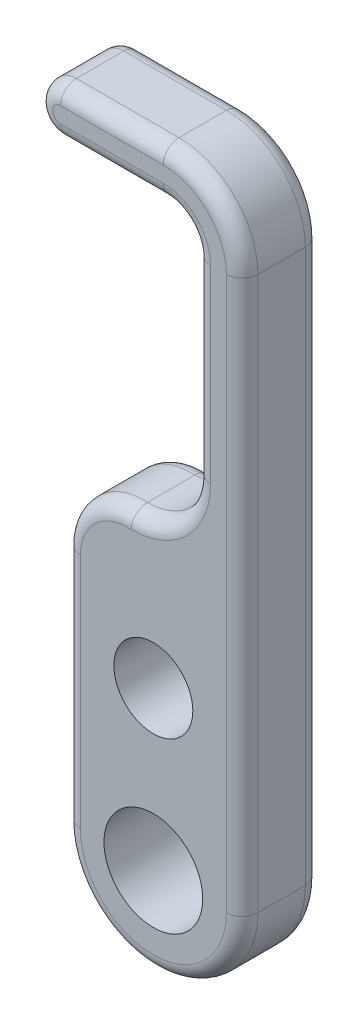
ISO-10303-21;
HEADER;
FILE_DESCRIPTION(('STEP AP214'),'2;1');
FILE_NAME('part.step','',(''),(''),'','','');
FILE_SCHEMA(('AUTOMOTIVE_DESIGN { 1 0 10303 214 1 1 1 1 }'));
ENDSEC;
DATA;
#1=APPLICATION_CONTEXT('core data for automotive mechanical design processes');
#2=APPLICATION_PROTOCOL_DEFINITION('international standard','automotive_design',2000,#1);
#3=PRODUCT_CONTEXT('',#1,'mechanical');
#4=PRODUCT('Part','Part','',(#3));
#5=PRODUCT_RELATED_PRODUCT_CATEGORY('part','',(#4));
#6=PRODUCT_DEFINITION_FORMATION('','',#4);
#7=PRODUCT_DEFINITION_CONTEXT('part definition',#1,'design');
#8=PRODUCT_DEFINITION('design','',#6,#7);
#9=PRODUCT_DEFINITION_SHAPE('','',#8);
#10=(LENGTH_UNIT() NAMED_UNIT(*) SI_UNIT(.MILLI.,.METRE.));
#11=(NAMED_UNIT(*) PLANE_ANGLE_UNIT() SI_UNIT($,.RADIAN.));
#12=(NAMED_UNIT(*) SI_UNIT($,.STERADIAN.) SOLID_ANGLE_UNIT());
#13=UNCERTAINTY_MEASURE_WITH_UNIT(LENGTH_MEASURE(1.E-05),#10,'distance_accuracy_value','');
#14=(GEOMETRIC_REPRESENTATION_CONTEXT(3) GLOBAL_UNCERTAINTY_ASSIGNED_CONTEXT((#13)) GLOBAL_UNIT_ASSIGNED_CONTEXT((#10,
#11,#12)) REPRESENTATION_CONTEXT('',''));
#15=CARTESIAN_POINT('',(0.,0.,0.));
#16=DIRECTION('',(0.,0.,1.));
#17=DIRECTION('',(1.,0.,0.));
#18=AXIS2_PLACEMENT_3D('',#15,#16,#17);
#19=CARTESIAN_POINT('',(0.,0.,6.35));
#20=DIRECTION('',(0.,0.,-1.));
#21=DIRECTION('',(-1.,0.,0.));
#22=AXIS2_PLACEMENT_3D('',#19,#20,#21);
#23=PLANE('',#22);
#24=CARTESIAN_POINT('',(-1.74625,29.21,6.35));
#25=DIRECTION('',(0.,0.,-1.));
#26=DIRECTION('',(-1.,0.,0.));
#27=AXIS2_PLACEMENT_3D('',#24,#25,#26);
#28=CIRCLE('',#27,6.35000000000008);
#29=CARTESIAN_POINT('',(4.60375000000012,29.21,6.35));
#30=VERTEX_POINT('',#29);
#31=CARTESIAN_POINT('',(-1.78961734538547,22.860148090439,6.35));
#32=VERTEX_POINT('',#31);
#33=EDGE_CURVE('E203',#30,#32,#28,.T.);
#34=ORIENTED_EDGE('',*,*,#33,.T.);
#35=CARTESIAN_POINT('',(-2.05441176470594,19.05,6.35));
#36=DIRECTION('',(0.,0.,-1.));
#37=DIRECTION('',(-1.,0.,0.));
#38=AXIS2_PLACEMENT_3D('',#35,#36,#37);
#39=CIRCLE('',#38,3.81933823529406);
#40=CARTESIAN_POINT('',(-5.87375,19.05,6.35));
#41=VERTEX_POINT('',#40);
#42=EDGE_CURVE('E198',#32,#41,#39,.F.);
#43=ORIENTED_EDGE('',*,*,#42,.T.);
#44=DIRECTION('',(0.,-1.,0.));
#45=VECTOR('',#44,1.);
#46=CARTESIAN_POINT('',(-5.87375,0.,6.35));
#47=LINE('',#46,#45);
#48=CARTESIAN_POINT('',(-5.87375,0.,6.35));
#49=VERTEX_POINT('',#48);
#50=EDGE_CURVE('E192',#41,#49,#47,.T.);
#51=ORIENTED_EDGE('',*,*,#50,.T.);
#52=CARTESIAN_POINT('',(0.,0.,6.35));
#53=DIRECTION('',(0.,0.,-1.));
#54=DIRECTION('',(-1.,0.,0.));
#55=AXIS2_PLACEMENT_3D('',#52,#53,#54);
#56=CIRCLE('',#55,5.87375);
#57=CARTESIAN_POINT('',(5.87375,0.,6.35));
#58=VERTEX_POINT('',#57);
#59=EDGE_CURVE('E195',#49,#58,#56,.F.);
#60=ORIENTED_EDGE('',*,*,#59,.T.);
#61=DIRECTION('',(0.,1.,0.));
#62=VECTOR('',#61,1.);
#63=CARTESIAN_POINT('',(5.87374999999999,0.,6.35));
#64=LINE('',#63,#62);
#65=CARTESIAN_POINT('',(5.87375,44.45,6.35));
#66=VERTEX_POINT('',#65);
#67=EDGE_CURVE('E215',#58,#66,#64,.T.);
#68=ORIENTED_EDGE('',*,*,#67,.T.);
#69=CARTESIAN_POINT('',(0.793749999999997,44.45,6.35));
#70=DIRECTION('',(0.,0.,-1.));
#71=DIRECTION('',(-1.,0.,0.));
#72=AXIS2_PLACEMENT_3D('',#69,#70,#71);
#73=CIRCLE('',#72,5.08);
#74=CARTESIAN_POINT('',(0.793749999999979,49.53,6.35));
#75=VERTEX_POINT('',#74);
#76=EDGE_CURVE('E636',#66,#75,#73,.F.);
#77=ORIENTED_EDGE('',*,*,#76,.T.);
#78=DIRECTION('',(-1.,0.,0.));
#79=VECTOR('',#78,1.);
#80=CARTESIAN_POINT('',(0.,49.53,6.35));
#81=LINE('',#80,#79);
#82=CARTESIAN_POINT('',(-7.46125000000002,49.53,6.35));
#83=VERTEX_POINT('',#82);
#84=EDGE_CURVE('E437',#75,#83,#81,.T.);
#85=ORIENTED_EDGE('',*,*,#84,.T.);
#86=CARTESIAN_POINT('',(-7.46125000000002,48.895,6.35));
#87=DIRECTION('',(0.,0.,-1.));
#88=DIRECTION('',(-1.,0.,0.));
#89=AXIS2_PLACEMENT_3D('',#86,#87,#88);
#90=CIRCLE('',#89,0.635);
#91=CARTESIAN_POINT('',(-7.46125000000002,48.26,6.35));
#92=VERTEX_POINT('',#91);
#93=EDGE_CURVE('E424',#83,#92,#90,.F.);
#94=ORIENTED_EDGE('',*,*,#93,.T.);
#95=DIRECTION('',(1.,0.,0.));
#96=VECTOR('',#95,1.);
#97=CARTESIAN_POINT('',(0.,48.26,6.35));
#98=LINE('',#97,#96);
#99=CARTESIAN_POINT('',(0.79374999999997,48.26,6.35));
#100=VERTEX_POINT('',#99);
#101=EDGE_CURVE('E428',#92,#100,#98,.T.);
#102=ORIENTED_EDGE('',*,*,#101,.T.);
#103=CARTESIAN_POINT('',(0.793749999999997,44.45,6.35));
#104=DIRECTION('',(0.,0.,-1.));
#105=DIRECTION('',(-1.,0.,0.));
#106=AXIS2_PLACEMENT_3D('',#103,#104,#105);
#107=CIRCLE('',#106,3.81);
#108=CARTESIAN_POINT('',(4.60375,44.45,6.35));
#109=VERTEX_POINT('',#108);
#110=EDGE_CURVE('E431',#100,#109,#107,.T.);
#111=ORIENTED_EDGE('',*,*,#110,.T.);
#112=DIRECTION('',(0.,-1.,0.));
#113=VECTOR('',#112,1.);
#114=CARTESIAN_POINT('',(4.60375000000035,0.,6.35));
#115=LINE('',#114,#113);
#116=EDGE_CURVE('E435',#109,#30,#115,.T.);
#117=ORIENTED_EDGE('',*,*,#116,.T.);
#118=EDGE_LOOP('',(#34,#43,#51,#60,#68,#77,#85,#94,#102,#111,#117));
#119=FACE_BOUND('',#118,.T.);
#120=CARTESIAN_POINT('',(0.,0.,6.35));
#121=DIRECTION('',(0.,0.,1.));
#122=DIRECTION('',(1.,0.,0.));
#123=AXIS2_PLACEMENT_3D('',#120,#121,#122);
#124=CIRCLE('',#123,3.96875);
#125=CARTESIAN_POINT('',(3.96875,0.,6.35));
#126=VERTEX_POINT('',#125);
#127=EDGE_CURVE('E647',#126,#126,#124,.T.);
#128=ORIENTED_EDGE('',*,*,#127,.F.);
#129=EDGE_LOOP('',(#128));
#130=FACE_BOUND('',#129,.T.);
#131=CARTESIAN_POINT('',(0.,12.7,6.35));
#132=DIRECTION('',(0.,0.,1.));
#133=DIRECTION('',(1.,0.,0.));
#134=AXIS2_PLACEMENT_3D('',#131,#132,#133);
#135=CIRCLE('',#134,3.175);
#136=CARTESIAN_POINT('',(3.175,12.7,6.35));
#137=VERTEX_POINT('',#136);
#138=EDGE_CURVE('E892',#137,#137,#135,.T.);
#139=ORIENTED_EDGE('',*,*,#138,.F.);
#140=EDGE_LOOP('',(#139));
#141=FACE_BOUND('',#140,.T.);
#142=ADVANCED_FACE('F39',(#119,#130,#141),#23,.F.);
#143=CARTESIAN_POINT('',(0.,0.,0.));
#144=DIRECTION('',(0.,0.,-1.));
#145=DIRECTION('',(-1.,0.,0.));
#146=AXIS2_PLACEMENT_3D('',#143,#144,#145);
#147=PLANE('',#146);
#148=DIRECTION('',(0.,-1.,0.));
#149=VECTOR('',#148,1.);
#150=CARTESIAN_POINT('',(-5.87375,19.05,0.));
#151=LINE('',#150,#149);
#152=CARTESIAN_POINT('',(-5.87375,0.,0.));
#153=VERTEX_POINT('',#152);
#154=CARTESIAN_POINT('',(-5.87375,19.05,0.));
#155=VERTEX_POINT('',#154);
#156=EDGE_CURVE('E507',#153,#155,#151,.F.);
#157=ORIENTED_EDGE('',*,*,#156,.T.);
#158=CARTESIAN_POINT('',(-2.05441176470594,19.05,0.));
#159=DIRECTION('',(0.,0.,-1.));
#160=DIRECTION('',(-1.,0.,0.));
#161=AXIS2_PLACEMENT_3D('',#158,#159,#160);
#162=CIRCLE('',#161,3.81933823529406);
#163=CARTESIAN_POINT('',(-1.78961734538547,22.860148090439,0.));
#164=VERTEX_POINT('',#163);
#165=EDGE_CURVE('E536',#155,#164,#162,.T.);
#166=ORIENTED_EDGE('',*,*,#165,.T.);
#167=CARTESIAN_POINT('',(-1.74625,29.21,0.));
#168=DIRECTION('',(0.,0.,-1.));
#169=DIRECTION('',(-1.,0.,0.));
#170=AXIS2_PLACEMENT_3D('',#167,#168,#169);
#171=CIRCLE('',#170,6.35000000000008);
#172=CARTESIAN_POINT('',(4.60375000000012,29.21,0.));
#173=VERTEX_POINT('',#172);
#174=EDGE_CURVE('E64',#164,#173,#171,.F.);
#175=ORIENTED_EDGE('',*,*,#174,.T.);
#176=DIRECTION('',(0.,-1.,0.));
#177=VECTOR('',#176,1.);
#178=CARTESIAN_POINT('',(4.60375,44.45,0.));
#179=LINE('',#178,#177);
#180=CARTESIAN_POINT('',(4.60375,44.45,0.));
#181=VERTEX_POINT('',#180);
#182=EDGE_CURVE('E531',#173,#181,#179,.F.);
#183=ORIENTED_EDGE('',*,*,#182,.T.);
#184=CARTESIAN_POINT('',(0.793749999999997,44.45,0.));
#185=DIRECTION('',(0.,0.,-1.));
#186=DIRECTION('',(-1.,0.,0.));
#187=AXIS2_PLACEMENT_3D('',#184,#185,#186);
#188=CIRCLE('',#187,3.81);
#189=CARTESIAN_POINT('',(0.79374999999997,48.26,0.));
#190=VERTEX_POINT('',#189);
#191=EDGE_CURVE('E528',#181,#190,#188,.F.);
#192=ORIENTED_EDGE('',*,*,#191,.T.);
#193=DIRECTION('',(1.,0.,0.));
#194=VECTOR('',#193,1.);
#195=CARTESIAN_POINT('',(-7.46125000000002,48.26,0.));
#196=LINE('',#195,#194);
#197=CARTESIAN_POINT('',(-7.46125000000002,48.26,0.));
#198=VERTEX_POINT('',#197);
#199=EDGE_CURVE('E525',#190,#198,#196,.F.);
#200=ORIENTED_EDGE('',*,*,#199,.T.);
#201=CARTESIAN_POINT('',(-7.46125000000002,48.895,0.));
#202=DIRECTION('',(0.,0.,-1.));
#203=DIRECTION('',(-1.,0.,0.));
#204=AXIS2_PLACEMENT_3D('',#201,#202,#203);
#205=CIRCLE('',#204,0.635);
#206=CARTESIAN_POINT('',(-7.46125000000002,49.53,0.));
#207=VERTEX_POINT('',#206);
#208=EDGE_CURVE('E522',#198,#207,#205,.T.);
#209=ORIENTED_EDGE('',*,*,#208,.T.);
#210=DIRECTION('',(-1.,0.,0.));
#211=VECTOR('',#210,1.);
#212=CARTESIAN_POINT('',(0.793749999999979,49.53,0.));
#213=LINE('',#212,#211);
#214=CARTESIAN_POINT('',(0.793749999999979,49.53,0.));
#215=VERTEX_POINT('',#214);
#216=EDGE_CURVE('E519',#207,#215,#213,.F.);
#217=ORIENTED_EDGE('',*,*,#216,.T.);
#218=CARTESIAN_POINT('',(0.793749999999997,44.45,0.));
#219=DIRECTION('',(0.,0.,-1.));
#220=DIRECTION('',(-1.,0.,0.));
#221=AXIS2_PLACEMENT_3D('',#218,#219,#220);
#222=CIRCLE('',#221,5.08);
#223=CARTESIAN_POINT('',(5.87375,44.45,0.));
#224=VERTEX_POINT('',#223);
#225=EDGE_CURVE('E516',#215,#224,#222,.T.);
#226=ORIENTED_EDGE('',*,*,#225,.T.);
#227=DIRECTION('',(0.,1.,0.));
#228=VECTOR('',#227,1.);
#229=CARTESIAN_POINT('',(5.87374999999999,0.,0.));
#230=LINE('',#229,#228);
#231=CARTESIAN_POINT('',(5.87375,0.,0.));
#232=VERTEX_POINT('',#231);
#233=EDGE_CURVE('E513',#224,#232,#230,.F.);
#234=ORIENTED_EDGE('',*,*,#233,.T.);
#235=CARTESIAN_POINT('',(0.,0.,0.));
#236=DIRECTION('',(0.,0.,-1.));
#237=DIRECTION('',(-1.,0.,0.));
#238=AXIS2_PLACEMENT_3D('',#235,#236,#237);
#239=CIRCLE('',#238,5.87375);
#240=EDGE_CURVE('E510',#232,#153,#239,.T.);
#241=ORIENTED_EDGE('',*,*,#240,.T.);
#242=EDGE_LOOP('',(#157,#166,#175,#183,#192,#200,#209,#217,#226,#234,#241));
#243=FACE_BOUND('',#242,.T.);
#244=CARTESIAN_POINT('',(0.,0.,0.));
#245=DIRECTION('',(0.,0.,1.));
#246=DIRECTION('',(1.,0.,0.));
#247=AXIS2_PLACEMENT_3D('',#244,#245,#246);
#248=CIRCLE('',#247,3.96875);
#249=CARTESIAN_POINT('',(3.96875,0.,0.));
#250=VERTEX_POINT('',#249);
#251=EDGE_CURVE('E654',#250,#250,#248,.T.);
#252=ORIENTED_EDGE('',*,*,#251,.T.);
#253=EDGE_LOOP('',(#252));
#254=FACE_BOUND('',#253,.T.);
#255=CARTESIAN_POINT('',(0.,12.7,0.));
#256=DIRECTION('',(0.,0.,1.));
#257=DIRECTION('',(1.,0.,0.));
#258=AXIS2_PLACEMENT_3D('',#255,#256,#257);
#259=CIRCLE('',#258,3.175);
#260=CARTESIAN_POINT('',(3.175,12.7,0.));
#261=VERTEX_POINT('',#260);
#262=EDGE_CURVE('E264',#261,#261,#259,.T.);
#263=ORIENTED_EDGE('',*,*,#262,.T.);
#264=EDGE_LOOP('',(#263));
#265=FACE_BOUND('',#264,.T.);
#266=ADVANCED_FACE('F322',(#243,#254,#265),#147,.T.);
#267=CARTESIAN_POINT('',(0.,0.,6.35));
#268=DIRECTION('',(0.,0.,-1.));
#269=DIRECTION('',(-1.,0.,0.));
#270=AXIS2_PLACEMENT_3D('',#267,#268,#269);
#271=CYLINDRICAL_SURFACE('',#270,7.14375);
#272=DIRECTION('',(0.,0.,-1.));
#273=VECTOR('',#272,1.);
#274=CARTESIAN_POINT('',(7.14375,0.,6.35));
#275=LINE('',#274,#273);
#276=CARTESIAN_POINT('',(7.14375,0.,5.08));
#277=VERTEX_POINT('',#276);
#278=CARTESIAN_POINT('',(7.14375,0.,1.27));
#279=VERTEX_POINT('',#278);
#280=EDGE_CURVE('E216',#277,#279,#275,.T.);
#281=ORIENTED_EDGE('',*,*,#280,.F.);
#282=CARTESIAN_POINT('',(0.,0.,5.08));
#283=DIRECTION('',(0.,0.,-1.));
#284=DIRECTION('',(-1.,0.,0.));
#285=AXIS2_PLACEMENT_3D('',#282,#283,#284);
#286=CIRCLE('',#285,7.14375);
#287=CARTESIAN_POINT('',(-7.14375,0.,5.08));
#288=VERTEX_POINT('',#287);
#289=EDGE_CURVE('E11',#277,#288,#286,.T.);
#290=ORIENTED_EDGE('',*,*,#289,.T.);
#291=DIRECTION('',(0.,0.,-1.));
#292=VECTOR('',#291,1.);
#293=CARTESIAN_POINT('',(-7.14375,0.,6.35));
#294=LINE('',#293,#292);
#295=CARTESIAN_POINT('',(-7.14375,0.,1.27));
#296=VERTEX_POINT('',#295);
#297=EDGE_CURVE('E591',#288,#296,#294,.T.);
#298=ORIENTED_EDGE('',*,*,#297,.T.);
#299=CARTESIAN_POINT('',(0.,0.,1.27));
#300=DIRECTION('',(0.,0.,-1.));
#301=DIRECTION('',(-1.,0.,0.));
#302=AXIS2_PLACEMENT_3D('',#299,#300,#301);
#303=CIRCLE('',#302,7.14375);
#304=EDGE_CURVE('E49',#296,#279,#303,.F.);
#305=ORIENTED_EDGE('',*,*,#304,.T.);
#306=EDGE_LOOP('',(#281,#290,#298,#305));
#307=FACE_BOUND('',#306,.T.);
#308=ADVANCED_FACE('F328',(#307),#271,.T.);
#309=CARTESIAN_POINT('',(7.14375,19.05,6.35));
#310=DIRECTION('',(-1.,0.,0.));
#311=DIRECTION('',(0.,-1.,0.));
#312=AXIS2_PLACEMENT_3D('',#309,#310,#311);
#313=PLANE('',#312);
#314=DIRECTION('',(0.,0.,-1.));
#315=VECTOR('',#314,1.);
#316=CARTESIAN_POINT('',(7.14375,44.45,6.35));
#317=LINE('',#316,#315);
#318=CARTESIAN_POINT('',(7.14375,44.45,5.08));
#319=VERTEX_POINT('',#318);
#320=CARTESIAN_POINT('',(7.14375,44.45,1.27));
#321=VERTEX_POINT('',#320);
#322=EDGE_CURVE('E597',#319,#321,#317,.T.);
#323=ORIENTED_EDGE('',*,*,#322,.F.);
#324=DIRECTION('',(0.,1.,0.));
#325=VECTOR('',#324,1.);
#326=CARTESIAN_POINT('',(7.14375,19.05,5.08));
#327=LINE('',#326,#325);
#328=EDGE_CURVE('E504',#319,#277,#327,.F.);
#329=ORIENTED_EDGE('',*,*,#328,.T.);
#330=ORIENTED_EDGE('',*,*,#280,.T.);
#331=DIRECTION('',(0.,1.,0.));
#332=VECTOR('',#331,1.);
#333=CARTESIAN_POINT('',(7.14375,44.45,1.27));
#334=LINE('',#333,#332);
#335=EDGE_CURVE('E501',#279,#321,#334,.T.);
#336=ORIENTED_EDGE('',*,*,#335,.T.);
#337=EDGE_LOOP('',(#323,#329,#330,#336));
#338=FACE_BOUND('',#337,.T.);
#339=ADVANCED_FACE('F369',(#338),#313,.F.);
#340=CARTESIAN_POINT('',(0.793749999999997,44.45,6.35));
#341=DIRECTION('',(0.,0.,-1.));
#342=DIRECTION('',(-1.,0.,0.));
#343=AXIS2_PLACEMENT_3D('',#340,#341,#342);
#344=CYLINDRICAL_SURFACE('',#343,6.35);
#345=DIRECTION('',(0.,0.,-1.));
#346=VECTOR('',#345,1.);
#347=CARTESIAN_POINT('',(0.793749999999979,50.8,6.35));
#348=LINE('',#347,#346);
#349=CARTESIAN_POINT('',(0.793749999999979,50.8,5.08));
#350=VERTEX_POINT('',#349);
#351=CARTESIAN_POINT('',(0.793749999999979,50.8,1.27));
#352=VERTEX_POINT('',#351);
#353=EDGE_CURVE('E606',#350,#352,#348,.T.);
#354=ORIENTED_EDGE('',*,*,#353,.F.);
#355=CARTESIAN_POINT('',(0.793749999999997,44.45,5.08));
#356=DIRECTION('',(0.,0.,-1.));
#357=DIRECTION('',(-1.,0.,0.));
#358=AXIS2_PLACEMENT_3D('',#355,#356,#357);
#359=CIRCLE('',#358,6.35);
#360=EDGE_CURVE('E498',#350,#319,#359,.T.);
#361=ORIENTED_EDGE('',*,*,#360,.T.);
#362=ORIENTED_EDGE('',*,*,#322,.T.);
#363=CARTESIAN_POINT('',(0.793749999999997,44.45,1.27));
#364=DIRECTION('',(0.,0.,-1.));
#365=DIRECTION('',(-1.,0.,0.));
#366=AXIS2_PLACEMENT_3D('',#363,#364,#365);
#367=CIRCLE('',#366,6.35);
#368=EDGE_CURVE('E495',#321,#352,#367,.F.);
#369=ORIENTED_EDGE('',*,*,#368,.T.);
#370=EDGE_LOOP('',(#354,#361,#362,#369));
#371=FACE_BOUND('',#370,.T.);
#372=ADVANCED_FACE('F365',(#371),#344,.T.);
#373=CARTESIAN_POINT('',(0.793749999999979,50.8,6.35));
#374=DIRECTION('',(0.,-1.,0.));
#375=DIRECTION('',(0.,0.,-1.));
#376=AXIS2_PLACEMENT_3D('',#373,#374,#375);
#377=PLANE('',#376);
#378=DIRECTION('',(0.,0.,-1.));
#379=VECTOR('',#378,1.);
#380=CARTESIAN_POINT('',(-7.46125000000002,50.8,6.35));
#381=LINE('',#380,#379);
#382=CARTESIAN_POINT('',(-7.46125000000002,50.8,5.08));
#383=VERTEX_POINT('',#382);
#384=CARTESIAN_POINT('',(-7.46125000000002,50.8,1.27));
#385=VERTEX_POINT('',#384);
#386=EDGE_CURVE('E612',#383,#385,#381,.T.);
#387=ORIENTED_EDGE('',*,*,#386,.F.);
#388=DIRECTION('',(-1.,0.,0.));
#389=VECTOR('',#388,1.);
#390=CARTESIAN_POINT('',(0.793749999999979,50.8,5.08));
#391=LINE('',#390,#389);
#392=EDGE_CURVE('E492',#383,#350,#391,.F.);
#393=ORIENTED_EDGE('',*,*,#392,.T.);
#394=ORIENTED_EDGE('',*,*,#353,.T.);
#395=DIRECTION('',(-1.,0.,0.));
#396=VECTOR('',#395,1.);
#397=CARTESIAN_POINT('',(-7.46125000000002,50.8,1.27));
#398=LINE('',#397,#396);
#399=EDGE_CURVE('E489',#352,#385,#398,.T.);
#400=ORIENTED_EDGE('',*,*,#399,.T.);
#401=EDGE_LOOP('',(#387,#393,#394,#400));
#402=FACE_BOUND('',#401,.T.);
#403=ADVANCED_FACE('F361',(#402),#377,.F.);
#404=CARTESIAN_POINT('',(-7.46125000000002,48.895,6.35));
#405=DIRECTION('',(0.,0.,-1.));
#406=DIRECTION('',(-1.,0.,0.));
#407=AXIS2_PLACEMENT_3D('',#404,#405,#406);
#408=CYLINDRICAL_SURFACE('',#407,1.905);
#409=DIRECTION('',(0.,0.,-1.));
#410=VECTOR('',#409,1.);
#411=CARTESIAN_POINT('',(-7.46125000000002,46.99,6.35));
#412=LINE('',#411,#410);
#413=CARTESIAN_POINT('',(-7.46125000000002,46.99,5.08));
#414=VERTEX_POINT('',#413);
#415=CARTESIAN_POINT('',(-7.46125000000002,46.99,1.27));
#416=VERTEX_POINT('',#415);
#417=EDGE_CURVE('E619',#414,#416,#412,.T.);
#418=ORIENTED_EDGE('',*,*,#417,.F.);
#419=CARTESIAN_POINT('',(-7.46125000000002,48.895,5.08));
#420=DIRECTION('',(0.,0.,-1.));
#421=DIRECTION('',(-1.,0.,0.));
#422=AXIS2_PLACEMENT_3D('',#419,#420,#421);
#423=CIRCLE('',#422,1.905);
#424=EDGE_CURVE('E425',#414,#383,#423,.T.);
#425=ORIENTED_EDGE('',*,*,#424,.T.);
#426=ORIENTED_EDGE('',*,*,#386,.T.);
#427=CARTESIAN_POINT('',(-7.46125000000002,48.895,1.27));
#428=DIRECTION('',(0.,0.,-1.));
#429=DIRECTION('',(-1.,0.,0.));
#430=AXIS2_PLACEMENT_3D('',#427,#428,#429);
#431=CIRCLE('',#430,1.905);
#432=EDGE_CURVE('E484',#385,#416,#431,.F.);
#433=ORIENTED_EDGE('',*,*,#432,.T.);
#434=EDGE_LOOP('',(#418,#425,#426,#433));
#435=FACE_BOUND('',#434,.T.);
#436=ADVANCED_FACE('F357',(#435),#408,.T.);
#437=CARTESIAN_POINT('',(-7.46125000000002,46.99,6.35));
#438=DIRECTION('',(0.,1.,0.));
#439=DIRECTION('',(0.,0.,1.));
#440=AXIS2_PLACEMENT_3D('',#437,#438,#439);
#441=PLANE('',#440);
#442=DIRECTION('',(0.,0.,-1.));
#443=VECTOR('',#442,1.);
#444=CARTESIAN_POINT('',(0.793749999999979,46.99,6.35));
#445=LINE('',#444,#443);
#446=CARTESIAN_POINT('',(0.793749999999979,46.99,5.08));
#447=VERTEX_POINT('',#446);
#448=CARTESIAN_POINT('',(0.793749999999979,46.99,1.27));
#449=VERTEX_POINT('',#448);
#450=EDGE_CURVE('E623',#447,#449,#445,.T.);
#451=ORIENTED_EDGE('',*,*,#450,.F.);
#452=DIRECTION('',(1.,0.,0.));
#453=VECTOR('',#452,1.);
#454=CARTESIAN_POINT('',(-7.46125000000002,46.99,5.08));
#455=LINE('',#454,#453);
#456=EDGE_CURVE('E481',#447,#414,#455,.F.);
#457=ORIENTED_EDGE('',*,*,#456,.T.);
#458=ORIENTED_EDGE('',*,*,#417,.T.);
#459=DIRECTION('',(1.,0.,0.));
#460=VECTOR('',#459,1.);
#461=CARTESIAN_POINT('',(0.793749999999979,46.99,1.27));
#462=LINE('',#461,#460);
#463=EDGE_CURVE('E478',#416,#449,#462,.T.);
#464=ORIENTED_EDGE('',*,*,#463,.T.);
#465=EDGE_LOOP('',(#451,#457,#458,#464));
#466=FACE_BOUND('',#465,.T.);
#467=ADVANCED_FACE('F353',(#466),#441,.F.);
#468=CARTESIAN_POINT('',(0.793749999999997,44.45,6.35));
#469=DIRECTION('',(0.,0.,-1.));
#470=DIRECTION('',(-1.,0.,0.));
#471=AXIS2_PLACEMENT_3D('',#468,#469,#470);
#472=CYLINDRICAL_SURFACE('',#471,2.54);
#473=DIRECTION('',(0.,0.,-1.));
#474=VECTOR('',#473,1.);
#475=CARTESIAN_POINT('',(3.33375,44.45,6.35));
#476=LINE('',#475,#474);
#477=CARTESIAN_POINT('',(3.33375,44.45,5.08));
#478=VERTEX_POINT('',#477);
#479=CARTESIAN_POINT('',(3.33375,44.45,1.27));
#480=VERTEX_POINT('',#479);
#481=EDGE_CURVE('E628',#478,#480,#476,.T.);
#482=ORIENTED_EDGE('',*,*,#481,.F.);
#483=CARTESIAN_POINT('',(0.793749999999997,44.45,5.08));
#484=DIRECTION('',(0.,0.,-1.));
#485=DIRECTION('',(-1.,0.,0.));
#486=AXIS2_PLACEMENT_3D('',#483,#484,#485);
#487=CIRCLE('',#486,2.54);
#488=EDGE_CURVE('E475',#478,#447,#487,.F.);
#489=ORIENTED_EDGE('',*,*,#488,.T.);
#490=ORIENTED_EDGE('',*,*,#450,.T.);
#491=CARTESIAN_POINT('',(0.793749999999997,44.45,1.27));
#492=DIRECTION('',(0.,0.,-1.));
#493=DIRECTION('',(-1.,0.,0.));
#494=AXIS2_PLACEMENT_3D('',#491,#492,#493);
#495=CIRCLE('',#494,2.54);
#496=EDGE_CURVE('E472',#449,#480,#495,.T.);
#497=ORIENTED_EDGE('',*,*,#496,.T.);
#498=EDGE_LOOP('',(#482,#489,#490,#497));
#499=FACE_BOUND('',#498,.T.);
#500=ADVANCED_FACE('F349',(#499),#472,.F.);
#501=CARTESIAN_POINT('',(3.33375,44.45,6.35));
#502=DIRECTION('',(1.,0.,0.));
#503=DIRECTION('',(0.,1.,0.));
#504=AXIS2_PLACEMENT_3D('',#501,#502,#503);
#505=PLANE('',#504);
#506=DIRECTION('',(0.,0.,-1.));
#507=VECTOR('',#506,1.);
#508=CARTESIAN_POINT('',(3.33375000000012,29.21,6.35));
#509=LINE('',#508,#507);
#510=CARTESIAN_POINT('',(3.33375000000012,29.21,5.08));
#511=VERTEX_POINT('',#510);
#512=CARTESIAN_POINT('',(3.33375000000012,29.21,1.27));
#513=VERTEX_POINT('',#512);
#514=EDGE_CURVE('E661',#511,#513,#509,.T.);
#515=ORIENTED_EDGE('',*,*,#514,.F.);
#516=DIRECTION('',(0.,-1.,0.));
#517=VECTOR('',#516,1.);
#518=CARTESIAN_POINT('',(3.33375,44.45,5.08));
#519=LINE('',#518,#517);
#520=EDGE_CURVE('E469',#511,#478,#519,.F.);
#521=ORIENTED_EDGE('',*,*,#520,.T.);
#522=ORIENTED_EDGE('',*,*,#481,.T.);
#523=DIRECTION('',(0.,-1.,0.));
#524=VECTOR('',#523,1.);
#525=CARTESIAN_POINT('',(3.33375000000012,29.21,1.27));
#526=LINE('',#525,#524);
#527=EDGE_CURVE('E466',#480,#513,#526,.T.);
#528=ORIENTED_EDGE('',*,*,#527,.T.);
#529=EDGE_LOOP('',(#515,#521,#522,#528));
#530=FACE_BOUND('',#529,.T.);
#531=ADVANCED_FACE('F345',(#530),#505,.F.);
#532=CARTESIAN_POINT('',(-1.74625,29.21,6.35));
#533=DIRECTION('',(0.,0.,-1.));
#534=DIRECTION('',(-1.,0.,0.));
#535=AXIS2_PLACEMENT_3D('',#532,#533,#534);
#536=CYLINDRICAL_SURFACE('',#535,5.08000000000008);
#537=DIRECTION('',(0.,0.,-1.));
#538=VECTOR('',#537,1.);
#539=CARTESIAN_POINT('',(-1.74624999999979,24.1299999999999,6.35));
#540=LINE('',#539,#538);
#541=CARTESIAN_POINT('',(-1.74624999999979,24.1299999999999,5.08));
#542=VERTEX_POINT('',#541);
#543=CARTESIAN_POINT('',(-1.74624999999979,24.1299999999999,1.27));
#544=VERTEX_POINT('',#543);
#545=EDGE_CURVE('E651',#542,#544,#540,.T.);
#546=ORIENTED_EDGE('',*,*,#545,.F.);
#547=CARTESIAN_POINT('',(-1.74625,29.21,5.08));
#548=DIRECTION('',(0.,0.,-1.));
#549=DIRECTION('',(-1.,0.,0.));
#550=AXIS2_PLACEMENT_3D('',#547,#548,#549);
#551=CIRCLE('',#550,5.08000000000008);
#552=EDGE_CURVE('E463',#542,#511,#551,.F.);
#553=ORIENTED_EDGE('',*,*,#552,.T.);
#554=ORIENTED_EDGE('',*,*,#514,.T.);
#555=CARTESIAN_POINT('',(-1.74625,29.21,1.27));
#556=DIRECTION('',(0.,0.,-1.));
#557=DIRECTION('',(-1.,0.,0.));
#558=AXIS2_PLACEMENT_3D('',#555,#556,#557);
#559=CIRCLE('',#558,5.08000000000008);
#560=EDGE_CURVE('E460',#513,#544,#559,.T.);
#561=ORIENTED_EDGE('',*,*,#560,.T.);
#562=EDGE_LOOP('',(#546,#553,#554,#561));
#563=FACE_BOUND('',#562,.T.);
#564=ADVANCED_FACE('F341',(#563),#536,.F.);
#565=CARTESIAN_POINT('',(-2.05441176470594,19.05,6.35));
#566=DIRECTION('',(0.,0.,-1.));
#567=DIRECTION('',(-1.,0.,0.));
#568=AXIS2_PLACEMENT_3D('',#565,#566,#567);
#569=CYLINDRICAL_SURFACE('',#568,5.08933823529406);
#570=DIRECTION('',(0.,0.,-1.));
#571=VECTOR('',#570,1.);
#572=CARTESIAN_POINT('',(-7.14375,19.05,6.35));
#573=LINE('',#572,#571);
#574=CARTESIAN_POINT('',(-7.14375,19.05,5.08));
#575=VERTEX_POINT('',#574);
#576=CARTESIAN_POINT('',(-7.14375,19.05,1.27));
#577=VERTEX_POINT('',#576);
#578=EDGE_CURVE('E646',#575,#577,#573,.T.);
#579=ORIENTED_EDGE('',*,*,#578,.F.);
#580=CARTESIAN_POINT('',(-2.05441176470594,19.05,5.08));
#581=DIRECTION('',(0.,0.,-1.));
#582=DIRECTION('',(-1.,0.,0.));
#583=AXIS2_PLACEMENT_3D('',#580,#581,#582);
#584=CIRCLE('',#583,5.08933823529406);
#585=EDGE_CURVE('E451',#575,#542,#584,.T.);
#586=ORIENTED_EDGE('',*,*,#585,.T.);
#587=ORIENTED_EDGE('',*,*,#545,.T.);
#588=CARTESIAN_POINT('',(-2.05441176470594,19.05,1.27));
#589=DIRECTION('',(0.,0.,-1.));
#590=DIRECTION('',(-1.,0.,0.));
#591=AXIS2_PLACEMENT_3D('',#588,#589,#590);
#592=CIRCLE('',#591,5.08933823529406);
#593=EDGE_CURVE('E447',#544,#577,#592,.F.);
#594=ORIENTED_EDGE('',*,*,#593,.T.);
#595=EDGE_LOOP('',(#579,#586,#587,#594));
#596=FACE_BOUND('',#595,.T.);
#597=ADVANCED_FACE('F337',(#596),#569,.T.);
#598=CARTESIAN_POINT('',(-7.14375,0.,6.35));
#599=DIRECTION('',(1.,0.,0.));
#600=DIRECTION('',(0.,0.,-1.));
#601=AXIS2_PLACEMENT_3D('',#598,#599,#600);
#602=PLANE('',#601);
#603=ORIENTED_EDGE('',*,*,#297,.F.);
#604=DIRECTION('',(0.,-1.,0.));
#605=VECTOR('',#604,1.);
#606=CARTESIAN_POINT('',(-7.14375,0.,5.08));
#607=LINE('',#606,#605);
#608=EDGE_CURVE('E219',#288,#575,#607,.F.);
#609=ORIENTED_EDGE('',*,*,#608,.T.);
#610=ORIENTED_EDGE('',*,*,#578,.T.);
#611=DIRECTION('',(0.,-1.,0.));
#612=VECTOR('',#611,1.);
#613=CARTESIAN_POINT('',(-7.14375,0.,1.27));
#614=LINE('',#613,#612);
#615=EDGE_CURVE('E455',#577,#296,#614,.T.);
#616=ORIENTED_EDGE('',*,*,#615,.T.);
#617=EDGE_LOOP('',(#603,#609,#610,#616));
#618=FACE_BOUND('',#617,.T.);
#619=ADVANCED_FACE('F334',(#618),#602,.F.);
#620=CARTESIAN_POINT('',(0.,0.,6.35));
#621=DIRECTION('',(0.,0.,-1.));
#622=DIRECTION('',(-1.,0.,0.));
#623=AXIS2_PLACEMENT_3D('',#620,#621,#622);
#624=CYLINDRICAL_SURFACE('',#623,3.96875);
#625=ORIENTED_EDGE('',*,*,#127,.T.);
#626=EDGE_LOOP('',(#625));
#627=FACE_BOUND('',#626,.T.);
#628=ORIENTED_EDGE('',*,*,#251,.F.);
#629=EDGE_LOOP('',(#628));
#630=FACE_BOUND('',#629,.T.);
#631=ADVANCED_FACE('F331',(#627,#630),#624,.F.);
#632=CARTESIAN_POINT('',(0.,12.7,6.35));
#633=DIRECTION('',(0.,0.,-1.));
#634=DIRECTION('',(-1.,0.,0.));
#635=AXIS2_PLACEMENT_3D('',#632,#633,#634);
#636=CYLINDRICAL_SURFACE('',#635,3.175);
#637=ORIENTED_EDGE('',*,*,#138,.T.);
#638=EDGE_LOOP('',(#637));
#639=FACE_BOUND('',#638,.T.);
#640=ORIENTED_EDGE('',*,*,#262,.F.);
#641=EDGE_LOOP('',(#640));
#642=FACE_BOUND('',#641,.T.);
#643=ADVANCED_FACE('F413',(#639,#642),#636,.F.);
#644=CARTESIAN_POINT('',(-7.46125000000002,48.895,5.08));
#645=DIRECTION('',(0.,0.,-1.));
#646=DIRECTION('',(-1.,0.,0.));
#647=AXIS2_PLACEMENT_3D('',#644,#645,#646);
#648=DEGENERATE_TOROIDAL_SURFACE('',#647,0.635,1.27,.T.);
#649=CARTESIAN_POINT('',(-7.46125000000002,48.26,5.08));
#650=DIRECTION('',(1.,0.,0.));
#651=DIRECTION('',(0.,0.,-1.));
#652=AXIS2_PLACEMENT_3D('',#649,#650,#651);
#653=CIRCLE('',#652,1.27);
#654=EDGE_CURVE('E256',#92,#414,#653,.T.);
#655=ORIENTED_EDGE('',*,*,#654,.F.);
#656=ORIENTED_EDGE('',*,*,#93,.F.);
#657=CARTESIAN_POINT('',(-7.46125000000002,49.53,5.08));
#658=DIRECTION('',(1.,0.,0.));
#659=DIRECTION('',(0.,1.,0.));
#660=AXIS2_PLACEMENT_3D('',#657,#658,#659);
#661=CIRCLE('',#660,1.27);
#662=EDGE_CURVE('E260',#383,#83,#661,.T.);
#663=ORIENTED_EDGE('',*,*,#662,.F.);
#664=ORIENTED_EDGE('',*,*,#424,.F.);
#665=EDGE_LOOP('',(#655,#656,#663,#664));
#666=FACE_BOUND('',#665,.T.);
#667=ADVANCED_FACE('F410',(#666),#648,.T.);
#668=CARTESIAN_POINT('',(0.,49.53,5.08));
#669=DIRECTION('',(-1.,0.,0.));
#670=DIRECTION('',(0.,0.,1.));
#671=AXIS2_PLACEMENT_3D('',#668,#669,#670);
#672=CYLINDRICAL_SURFACE('',#671,1.27);
#673=ORIENTED_EDGE('',*,*,#662,.T.);
#674=ORIENTED_EDGE('',*,*,#84,.F.);
#675=CARTESIAN_POINT('',(0.793749999999979,49.53,5.08));
#676=DIRECTION('',(1.,0.,0.));
#677=DIRECTION('',(0.,0.,-1.));
#678=AXIS2_PLACEMENT_3D('',#675,#676,#677);
#679=CIRCLE('',#678,1.27);
#680=EDGE_CURVE('E252',#350,#75,#679,.T.);
#681=ORIENTED_EDGE('',*,*,#680,.F.);
#682=ORIENTED_EDGE('',*,*,#392,.F.);
#683=EDGE_LOOP('',(#673,#674,#681,#682));
#684=FACE_BOUND('',#683,.T.);
#685=ADVANCED_FACE('F407',(#684),#672,.T.);
#686=CARTESIAN_POINT('',(0.,48.26,5.08));
#687=DIRECTION('',(1.,0.,0.));
#688=DIRECTION('',(0.,0.,-1.));
#689=AXIS2_PLACEMENT_3D('',#686,#687,#688);
#690=CYLINDRICAL_SURFACE('',#689,1.27);
#691=ORIENTED_EDGE('',*,*,#654,.T.);
#692=ORIENTED_EDGE('',*,*,#456,.F.);
#693=CARTESIAN_POINT('',(0.79374999999997,48.26,5.08));
#694=DIRECTION('',(1.,0.,0.));
#695=DIRECTION('',(0.,1.,0.));
#696=AXIS2_PLACEMENT_3D('',#693,#694,#695);
#697=CIRCLE('',#696,1.27);
#698=EDGE_CURVE('E248',#100,#447,#697,.T.);
#699=ORIENTED_EDGE('',*,*,#698,.F.);
#700=ORIENTED_EDGE('',*,*,#101,.F.);
#701=EDGE_LOOP('',(#691,#692,#699,#700));
#702=FACE_BOUND('',#701,.T.);
#703=ADVANCED_FACE('F403',(#702),#690,.T.);
#704=CARTESIAN_POINT('',(0.793749999999997,44.45,5.08));
#705=DIRECTION('',(0.,0.,-1.));
#706=DIRECTION('',(-1.,0.,0.));
#707=AXIS2_PLACEMENT_3D('',#704,#705,#706);
#708=TOROIDAL_SURFACE('',#707,5.08,1.27);
#709=ORIENTED_EDGE('',*,*,#680,.T.);
#710=ORIENTED_EDGE('',*,*,#76,.F.);
#711=CARTESIAN_POINT('',(5.87375,44.45,5.08));
#712=DIRECTION('',(0.,-1.,0.));
#713=DIRECTION('',(0.,0.,-1.));
#714=AXIS2_PLACEMENT_3D('',#711,#712,#713);
#715=CIRCLE('',#714,1.27);
#716=EDGE_CURVE('E244',#319,#66,#715,.T.);
#717=ORIENTED_EDGE('',*,*,#716,.F.);
#718=ORIENTED_EDGE('',*,*,#360,.F.);
#719=EDGE_LOOP('',(#709,#710,#717,#718));
#720=FACE_BOUND('',#719,.T.);
#721=ADVANCED_FACE('F399',(#720),#708,.T.);
#722=CARTESIAN_POINT('',(0.793749999999997,44.45,5.08));
#723=DIRECTION('',(0.,0.,-1.));
#724=DIRECTION('',(-1.,0.,0.));
#725=AXIS2_PLACEMENT_3D('',#722,#723,#724);
#726=TOROIDAL_SURFACE('',#725,3.81,1.27);
#727=ORIENTED_EDGE('',*,*,#698,.T.);
#728=ORIENTED_EDGE('',*,*,#488,.F.);
#729=CARTESIAN_POINT('',(4.60375,44.45,5.08));
#730=DIRECTION('',(0.,-1.,0.));
#731=DIRECTION('',(1.,0.,0.));
#732=AXIS2_PLACEMENT_3D('',#729,#730,#731);
#733=CIRCLE('',#732,1.27);
#734=EDGE_CURVE('E240',#109,#478,#733,.T.);
#735=ORIENTED_EDGE('',*,*,#734,.F.);
#736=ORIENTED_EDGE('',*,*,#110,.F.);
#737=EDGE_LOOP('',(#727,#728,#735,#736));
#738=FACE_BOUND('',#737,.T.);
#739=ADVANCED_FACE('F395',(#738),#726,.T.);
#740=CARTESIAN_POINT('',(5.87374999999999,0.,5.08));
#741=DIRECTION('',(0.,1.,0.));
#742=DIRECTION('',(-1.,0.,0.));
#743=AXIS2_PLACEMENT_3D('',#740,#741,#742);
#744=CYLINDRICAL_SURFACE('',#743,1.27);
#745=ORIENTED_EDGE('',*,*,#716,.T.);
#746=ORIENTED_EDGE('',*,*,#67,.F.);
#747=CARTESIAN_POINT('',(5.87374999999999,0.,5.08));
#748=DIRECTION('',(0.,-1.,0.));
#749=DIRECTION('',(1.,0.,0.));
#750=AXIS2_PLACEMENT_3D('',#747,#748,#749);
#751=CIRCLE('',#750,1.27);
#752=EDGE_CURVE('E213',#277,#58,#751,.T.);
#753=ORIENTED_EDGE('',*,*,#752,.F.);
#754=ORIENTED_EDGE('',*,*,#328,.F.);
#755=EDGE_LOOP('',(#745,#746,#753,#754));
#756=FACE_BOUND('',#755,.T.);
#757=ADVANCED_FACE('F391',(#756),#744,.T.);
#758=CARTESIAN_POINT('',(4.60375000000035,0.,5.08));
#759=DIRECTION('',(0.,-1.,0.));
#760=DIRECTION('',(1.,0.,0.));
#761=AXIS2_PLACEMENT_3D('',#758,#759,#760);
#762=CYLINDRICAL_SURFACE('',#761,1.27);
#763=ORIENTED_EDGE('',*,*,#734,.T.);
#764=ORIENTED_EDGE('',*,*,#520,.F.);
#765=CARTESIAN_POINT('',(4.60375000000012,29.21,5.08));
#766=DIRECTION('',(0.,-1.,0.));
#767=DIRECTION('',(0.,0.,-1.));
#768=AXIS2_PLACEMENT_3D('',#765,#766,#767);
#769=CIRCLE('',#768,1.27);
#770=EDGE_CURVE('E221',#30,#511,#769,.T.);
#771=ORIENTED_EDGE('',*,*,#770,.F.);
#772=ORIENTED_EDGE('',*,*,#116,.F.);
#773=EDGE_LOOP('',(#763,#764,#771,#772));
#774=FACE_BOUND('',#773,.T.);
#775=ADVANCED_FACE('F388',(#774),#762,.T.);
#776=CARTESIAN_POINT('',(0.,0.,5.08));
#777=DIRECTION('',(0.,0.,-1.));
#778=DIRECTION('',(-1.,0.,0.));
#779=AXIS2_PLACEMENT_3D('',#776,#777,#778);
#780=TOROIDAL_SURFACE('',#779,5.87375,1.27);
#781=ORIENTED_EDGE('',*,*,#752,.T.);
#782=ORIENTED_EDGE('',*,*,#59,.F.);
#783=CARTESIAN_POINT('',(-5.87375,0.,5.08));
#784=DIRECTION('',(0.,1.,0.));
#785=DIRECTION('',(0.,0.,1.));
#786=AXIS2_PLACEMENT_3D('',#783,#784,#785);
#787=CIRCLE('',#786,1.27);
#788=EDGE_CURVE('E210',#288,#49,#787,.T.);
#789=ORIENTED_EDGE('',*,*,#788,.F.);
#790=ORIENTED_EDGE('',*,*,#289,.F.);
#791=EDGE_LOOP('',(#781,#782,#789,#790));
#792=FACE_BOUND('',#791,.T.);
#793=ADVANCED_FACE('F208',(#792),#780,.T.);
#794=CARTESIAN_POINT('',(-1.74625,29.21,5.08));
#795=DIRECTION('',(0.,0.,-1.));
#796=DIRECTION('',(-1.,0.,0.));
#797=AXIS2_PLACEMENT_3D('',#794,#795,#796);
#798=TOROIDAL_SURFACE('',#797,6.35000000000008,1.27);
#799=ORIENTED_EDGE('',*,*,#770,.T.);
#800=ORIENTED_EDGE('',*,*,#552,.F.);
#801=CARTESIAN_POINT('',(-1.74624999999979,24.13,5.08));
#802=CARTESIAN_POINT('',(-1.74625007295732,24.1299997722091,5.1157179534788));
#803=CARTESIAN_POINT('',(-1.7462956826616,24.1284922358282,5.15141879013074));
#804=CARTESIAN_POINT('',(-1.74647806422739,24.1224781291156,5.22256492489951));
#805=CARTESIAN_POINT('',(-1.74661483164477,24.1179717049858,5.25801023538862));
#806=CARTESIAN_POINT('',(-1.74716142913216,24.0999963580012,5.36352403862586));
#807=CARTESIAN_POINT('',(-1.74770755455378,24.082071245895,5.43288556699705));
#808=CARTESIAN_POINT('',(-1.74915908830307,24.0348372270771,5.5676108434401));
#809=CARTESIAN_POINT('',(-1.75006466674091,24.0055229306037,5.63297268174155));
#810=CARTESIAN_POINT('',(-1.75222650548974,23.9363501477099,5.75784020172106));
#811=CARTESIAN_POINT('',(-1.75348268243457,23.8964941680337,5.81734727101613));
#812=CARTESIAN_POINT('',(-1.75633171282431,23.8073633793111,5.92883201624047));
#813=CARTESIAN_POINT('',(-1.75792461453781,23.7580872200046,5.98080861089454));
#814=CARTESIAN_POINT('',(-1.76142594447093,23.6514976718355,6.0757708164583));
#815=CARTESIAN_POINT('',(-1.76333448513363,23.5941814198828,6.11875321087282));
#816=CARTESIAN_POINT('',(-1.76743665937106,23.4731198585276,6.19451246972248));
#817=CARTESIAN_POINT('',(-1.76963050154555,23.4093698527646,6.22728180668929));
#818=CARTESIAN_POINT('',(-1.77425967379431,23.2773105058887,6.28162148435767));
#819=CARTESIAN_POINT('',(-1.77669476638544,23.2090056697184,6.30320271052388));
#820=CARTESIAN_POINT('',(-1.78071821974127,23.0982474034905,6.32818863461188));
#821=CARTESIAN_POINT('',(-1.78224685878999,23.0566125205693,6.33541677543167));
#822=CARTESIAN_POINT('',(-1.78535557304278,22.9728706684333,6.34568635587916));
#823=CARTESIAN_POINT('',(-1.78693557111712,22.9307644642109,6.34873380130186));
#824=CARTESIAN_POINT('',(-1.78889418958792,22.8791388066863,6.3498936704263));
#825=CARTESIAN_POINT('',(-1.78925534818106,22.8696426948023,6.35000028617191));
#826=CARTESIAN_POINT('',(-1.78961734538546,22.860148090439,6.35));
#827=B_SPLINE_CURVE_WITH_KNOTS('',3,(#801,#802,#803,#804,#805,#806,#807,#808,#809,#810,#811,
#812,#813,#814,#815,#816,#817,#818,#819,#820,#821,#822,#823,#824,#825,#826),.UNSPECIFIED.,.F.,
.F.,(4,2,2,2,2,2,2,2,2,2,2,2,4),(0.,0.107088029639223,0.214170838900141,0.427995364132612,
0.641921202129282,0.855796215602629,1.0697019082901,1.28368396743309,1.49782336973091,
1.71175403236915,1.83843231604905,1.9649284282884,1.99343639401679),.UNSPECIFIED.);
#828=EDGE_CURVE('E222',#32,#542,#827,.F.);
#829=ORIENTED_EDGE('',*,*,#828,.F.);
#830=ORIENTED_EDGE('',*,*,#33,.F.);
#831=EDGE_LOOP('',(#799,#800,#829,#830));
#832=FACE_BOUND('',#831,.T.);
#833=ADVANCED_FACE('F379',(#832),#798,.T.);
#834=CARTESIAN_POINT('',(-5.87375,0.,5.08));
#835=DIRECTION('',(0.,-1.,0.));
#836=DIRECTION('',(0.,0.,-1.));
#837=AXIS2_PLACEMENT_3D('',#834,#835,#836);
#838=CYLINDRICAL_SURFACE('',#837,1.27);
#839=ORIENTED_EDGE('',*,*,#788,.T.);
#840=ORIENTED_EDGE('',*,*,#50,.F.);
#841=CARTESIAN_POINT('',(-5.87375,19.05,5.08));
#842=DIRECTION('',(0.,1.,0.));
#843=DIRECTION('',(0.,0.,1.));
#844=AXIS2_PLACEMENT_3D('',#841,#842,#843);
#845=CIRCLE('',#844,1.27);
#846=EDGE_CURVE('E228',#575,#41,#845,.T.);
#847=ORIENTED_EDGE('',*,*,#846,.F.);
#848=ORIENTED_EDGE('',*,*,#608,.F.);
#849=EDGE_LOOP('',(#839,#840,#847,#848));
#850=FACE_BOUND('',#849,.T.);
#851=ADVANCED_FACE('F218',(#850),#838,.T.);
#852=CARTESIAN_POINT('',(-2.05441176470594,19.05,5.08));
#853=DIRECTION('',(0.,0.,-1.));
#854=DIRECTION('',(-1.,0.,0.));
#855=AXIS2_PLACEMENT_3D('',#852,#853,#854);
#856=TOROIDAL_SURFACE('',#855,3.81933823529406,1.27);
#857=ORIENTED_EDGE('',*,*,#828,.T.);
#858=ORIENTED_EDGE('',*,*,#585,.F.);
#859=ORIENTED_EDGE('',*,*,#846,.T.);
#860=ORIENTED_EDGE('',*,*,#42,.F.);
#861=EDGE_LOOP('',(#857,#858,#859,#860));
#862=FACE_BOUND('',#861,.T.);
#863=ADVANCED_FACE('F318',(#862),#856,.T.);
#864=CARTESIAN_POINT('',(-7.46125000000002,48.895,1.27));
#865=DIRECTION('',(0.,0.,-1.));
#866=DIRECTION('',(-1.,0.,0.));
#867=AXIS2_PLACEMENT_3D('',#864,#865,#866);
#868=DEGENERATE_TOROIDAL_SURFACE('',#867,0.635,1.27,.T.);
#869=CARTESIAN_POINT('',(-7.46125000000002,48.26,1.27));
#870=DIRECTION('',(1.,0.,0.));
#871=DIRECTION('',(0.,0.,-1.));
#872=AXIS2_PLACEMENT_3D('',#869,#870,#871);
#873=CIRCLE('',#872,1.27);
#874=EDGE_CURVE('E543',#416,#198,#873,.T.);
#875=ORIENTED_EDGE('',*,*,#874,.F.);
#876=ORIENTED_EDGE('',*,*,#432,.F.);
#877=CARTESIAN_POINT('',(-7.46125000000002,49.53,1.27));
#878=DIRECTION('',(1.,0.,0.));
#879=DIRECTION('',(0.,1.,0.));
#880=AXIS2_PLACEMENT_3D('',#877,#878,#879);
#881=CIRCLE('',#880,1.27);
#882=EDGE_CURVE('E43',#207,#385,#881,.T.);
#883=ORIENTED_EDGE('',*,*,#882,.F.);
#884=ORIENTED_EDGE('',*,*,#208,.F.);
#885=EDGE_LOOP('',(#875,#876,#883,#884));
#886=FACE_BOUND('',#885,.T.);
#887=ADVANCED_FACE('F41',(#886),#868,.T.);
#888=CARTESIAN_POINT('',(0.793749999999979,49.53,1.27));
#889=DIRECTION('',(1.,0.,0.));
#890=DIRECTION('',(0.,0.,-1.));
#891=AXIS2_PLACEMENT_3D('',#888,#889,#890);
#892=CYLINDRICAL_SURFACE('',#891,1.27);
#893=ORIENTED_EDGE('',*,*,#882,.T.);
#894=ORIENTED_EDGE('',*,*,#399,.F.);
#895=CARTESIAN_POINT('',(0.793749999999979,49.53,1.27));
#896=DIRECTION('',(1.,0.,0.));
#897=DIRECTION('',(0.,0.,-1.));
#898=AXIS2_PLACEMENT_3D('',#895,#896,#897);
#899=CIRCLE('',#898,1.27);
#900=EDGE_CURVE('E549',#215,#352,#899,.T.);
#901=ORIENTED_EDGE('',*,*,#900,.F.);
#902=ORIENTED_EDGE('',*,*,#216,.F.);
#903=EDGE_LOOP('',(#893,#894,#901,#902));
#904=FACE_BOUND('',#903,.T.);
#905=ADVANCED_FACE('F311',(#904),#892,.T.);
#906=CARTESIAN_POINT('',(-7.46125000000002,48.26,1.27));
#907=DIRECTION('',(-1.,0.,0.));
#908=DIRECTION('',(0.,0.,1.));
#909=AXIS2_PLACEMENT_3D('',#906,#907,#908);
#910=CYLINDRICAL_SURFACE('',#909,1.27);
#911=ORIENTED_EDGE('',*,*,#874,.T.);
#912=ORIENTED_EDGE('',*,*,#199,.F.);
#913=CARTESIAN_POINT('',(0.793749999999979,48.26,1.27));
#914=DIRECTION('',(1.,0.,0.));
#915=DIRECTION('',(0.,0.,-1.));
#916=AXIS2_PLACEMENT_3D('',#913,#914,#915);
#917=CIRCLE('',#916,1.27);
#918=EDGE_CURVE('E555',#449,#190,#917,.T.);
#919=ORIENTED_EDGE('',*,*,#918,.F.);
#920=ORIENTED_EDGE('',*,*,#463,.F.);
#921=EDGE_LOOP('',(#911,#912,#919,#920));
#922=FACE_BOUND('',#921,.T.);
#923=ADVANCED_FACE('F308',(#922),#910,.T.);
#924=CARTESIAN_POINT('',(0.793749999999997,44.45,1.27));
#925=DIRECTION('',(0.,0.,-1.));
#926=DIRECTION('',(-1.,0.,0.));
#927=AXIS2_PLACEMENT_3D('',#924,#925,#926);
#928=TOROIDAL_SURFACE('',#927,5.08,1.27);
#929=ORIENTED_EDGE('',*,*,#900,.T.);
#930=ORIENTED_EDGE('',*,*,#368,.F.);
#931=CARTESIAN_POINT('',(5.87375,44.45,1.27));
#932=DIRECTION('',(0.,-1.,0.));
#933=DIRECTION('',(0.,0.,-1.));
#934=AXIS2_PLACEMENT_3D('',#931,#932,#933);
#935=CIRCLE('',#934,1.27);
#936=EDGE_CURVE('E561',#224,#321,#935,.T.);
#937=ORIENTED_EDGE('',*,*,#936,.F.);
#938=ORIENTED_EDGE('',*,*,#225,.F.);
#939=EDGE_LOOP('',(#929,#930,#937,#938));
#940=FACE_BOUND('',#939,.T.);
#941=ADVANCED_FACE('F304',(#940),#928,.T.);
#942=CARTESIAN_POINT('',(0.793749999999997,44.45,1.27));
#943=DIRECTION('',(0.,0.,-1.));
#944=DIRECTION('',(-1.,0.,0.));
#945=AXIS2_PLACEMENT_3D('',#942,#943,#944);
#946=TOROIDAL_SURFACE('',#945,3.81,1.27);
#947=ORIENTED_EDGE('',*,*,#918,.T.);
#948=ORIENTED_EDGE('',*,*,#191,.F.);
#949=CARTESIAN_POINT('',(4.60375,44.45,1.27));
#950=DIRECTION('',(0.,-1.,0.));
#951=DIRECTION('',(1.,0.,0.));
#952=AXIS2_PLACEMENT_3D('',#949,#950,#951);
#953=CIRCLE('',#952,1.27);
#954=EDGE_CURVE('E565',#480,#181,#953,.T.);
#955=ORIENTED_EDGE('',*,*,#954,.F.);
#956=ORIENTED_EDGE('',*,*,#496,.F.);
#957=EDGE_LOOP('',(#947,#948,#955,#956));
#958=FACE_BOUND('',#957,.T.);
#959=ADVANCED_FACE('F300',(#958),#946,.T.);
#960=CARTESIAN_POINT('',(5.87375,19.05,1.27));
#961=DIRECTION('',(0.,-1.,0.));
#962=DIRECTION('',(1.,0.,0.));
#963=AXIS2_PLACEMENT_3D('',#960,#961,#962);
#964=CYLINDRICAL_SURFACE('',#963,1.27);
#965=ORIENTED_EDGE('',*,*,#936,.T.);
#966=ORIENTED_EDGE('',*,*,#335,.F.);
#967=CARTESIAN_POINT('',(5.87374999999999,0.,1.27));
#968=DIRECTION('',(0.,-1.,0.));
#969=DIRECTION('',(1.,0.,0.));
#970=AXIS2_PLACEMENT_3D('',#967,#968,#969);
#971=CIRCLE('',#970,1.27);
#972=EDGE_CURVE('E569',#232,#279,#971,.T.);
#973=ORIENTED_EDGE('',*,*,#972,.F.);
#974=ORIENTED_EDGE('',*,*,#233,.F.);
#975=EDGE_LOOP('',(#965,#966,#973,#974));
#976=FACE_BOUND('',#975,.T.);
#977=ADVANCED_FACE('F296',(#976),#964,.T.);
#978=CARTESIAN_POINT('',(4.60375,44.45,1.27));
#979=DIRECTION('',(0.,1.,0.));
#980=DIRECTION('',(-1.,0.,0.));
#981=AXIS2_PLACEMENT_3D('',#978,#979,#980);
#982=CYLINDRICAL_SURFACE('',#981,1.27);
#983=ORIENTED_EDGE('',*,*,#954,.T.);
#984=ORIENTED_EDGE('',*,*,#182,.F.);
#985=CARTESIAN_POINT('',(4.60375000000012,29.21,1.27));
#986=DIRECTION('',(0.,-1.,0.));
#987=DIRECTION('',(0.,0.,-1.));
#988=AXIS2_PLACEMENT_3D('',#985,#986,#987);
#989=CIRCLE('',#988,1.27);
#990=EDGE_CURVE('E572',#513,#173,#989,.T.);
#991=ORIENTED_EDGE('',*,*,#990,.F.);
#992=ORIENTED_EDGE('',*,*,#527,.F.);
#993=EDGE_LOOP('',(#983,#984,#991,#992));
#994=FACE_BOUND('',#993,.T.);
#995=ADVANCED_FACE('F292',(#994),#982,.T.);
#996=CARTESIAN_POINT('',(0.,0.,1.27));
#997=DIRECTION('',(0.,0.,-1.));
#998=DIRECTION('',(-1.,0.,0.));
#999=AXIS2_PLACEMENT_3D('',#996,#997,#998);
#1000=TOROIDAL_SURFACE('',#999,5.87375,1.27);
#1001=ORIENTED_EDGE('',*,*,#972,.T.);
#1002=ORIENTED_EDGE('',*,*,#304,.F.);
#1003=CARTESIAN_POINT('',(-5.87375,0.,1.27));
#1004=DIRECTION('',(0.,1.,0.));
#1005=DIRECTION('',(-1.,0.,0.));
#1006=AXIS2_PLACEMENT_3D('',#1003,#1004,#1005);
#1007=CIRCLE('',#1006,1.27);
#1008=EDGE_CURVE('E276',#153,#296,#1007,.T.);
#1009=ORIENTED_EDGE('',*,*,#1008,.F.);
#1010=ORIENTED_EDGE('',*,*,#240,.F.);
#1011=EDGE_LOOP('',(#1001,#1002,#1009,#1010));
#1012=FACE_BOUND('',#1011,.T.);
#1013=ADVANCED_FACE('F289',(#1012),#1000,.T.);
#1014=CARTESIAN_POINT('',(-1.74625,29.21,1.27));
#1015=DIRECTION('',(0.,0.,-1.));
#1016=DIRECTION('',(-1.,0.,0.));
#1017=AXIS2_PLACEMENT_3D('',#1014,#1015,#1016);
#1018=TOROIDAL_SURFACE('',#1017,6.35000000000008,1.27);
#1019=ORIENTED_EDGE('',*,*,#990,.T.);
#1020=ORIENTED_EDGE('',*,*,#174,.F.);
#1021=CARTESIAN_POINT('',(-1.74624999999979,24.13,1.27));
#1022=CARTESIAN_POINT('',(-1.74625007295732,24.1299997722091,1.2342820465212));
#1023=CARTESIAN_POINT('',(-1.7462956826616,24.1284922358282,1.19858120986926));
#1024=CARTESIAN_POINT('',(-1.74647806422739,24.1224781291156,1.12743507510049));
#1025=CARTESIAN_POINT('',(-1.74661483164478,24.1179717049858,1.09198976461138));
#1026=CARTESIAN_POINT('',(-1.74716142913218,24.0999963580012,0.986475961374136));
#1027=CARTESIAN_POINT('',(-1.74770755455378,24.082071245895,0.917114433002951));
#1028=CARTESIAN_POINT('',(-1.74915908830306,24.0348372270771,0.782389156559898));
#1029=CARTESIAN_POINT('',(-1.75006466674091,24.0055229306037,0.717027318258447));
#1030=CARTESIAN_POINT('',(-1.75222650548974,23.9363501477099,0.592159798278935));
#1031=CARTESIAN_POINT('',(-1.75348268243457,23.8964941680337,0.532652728983864));
#1032=CARTESIAN_POINT('',(-1.75633171282431,23.8073633793111,0.421167983759526));
#1033=CARTESIAN_POINT('',(-1.75792461453781,23.7580872200046,0.369191389105459));
#1034=CARTESIAN_POINT('',(-1.76142594447093,23.6514976718355,0.274229183541698));
#1035=CARTESIAN_POINT('',(-1.76333448513363,23.5941814198828,0.231246789127179));
#1036=CARTESIAN_POINT('',(-1.76743665937105,23.4731198585276,0.155487530277516));
#1037=CARTESIAN_POINT('',(-1.76963050154555,23.4093698527646,0.12271819331071));
#1038=CARTESIAN_POINT('',(-1.77425967379432,23.2773105058887,0.0683785156423303));
#1039=CARTESIAN_POINT('',(-1.77669476638546,23.2090056697184,0.0467972894761163));
#1040=CARTESIAN_POINT('',(-1.78071821974128,23.0982474034905,0.0218113653881177));
#1041=CARTESIAN_POINT('',(-1.78224685878998,23.0566125205693,0.014583224568331));
#1042=CARTESIAN_POINT('',(-1.78535557304278,22.9728706684333,0.00431364412083928));
#1043=CARTESIAN_POINT('',(-1.78693557111713,22.9307644642109,0.00126619869814454));
#1044=CARTESIAN_POINT('',(-1.78889418958792,22.8791388066863,0.000106329573702205));
#1045=CARTESIAN_POINT('',(-1.78925534818107,22.8696426948023,-2.86171913692107E-07));
#1046=CARTESIAN_POINT('',(-1.78961734538546,22.860148090439,0.));
#1047=B_SPLINE_CURVE_WITH_KNOTS('',3,(#1021,#1022,#1023,#1024,#1025,#1026,#1027,#1028,#1029,
#1030,#1031,#1032,#1033,#1034,#1035,#1036,#1037,#1038,#1039,#1040,#1041,#1042,#1043,#1044,#1045,
#1046),.UNSPECIFIED.,.F.,.F.,(4,2,2,2,2,2,2,2,2,2,2,2,4),(0.,0.107088029639224,0.21417083890014,
0.427995364132614,0.641921202129282,0.855796215602629,1.0697019082901,1.28368396743309,
1.49782336973092,1.71175403236915,1.83843231604906,1.9649284282884,1.99343639401679),.UNSPECIFIED.);
#1048=EDGE_CURVE('E57',#544,#164,#1047,.T.);
#1049=ORIENTED_EDGE('',*,*,#1048,.F.);
#1050=ORIENTED_EDGE('',*,*,#560,.F.);
#1051=EDGE_LOOP('',(#1019,#1020,#1049,#1050));
#1052=FACE_BOUND('',#1051,.T.);
#1053=ADVANCED_FACE('F278',(#1052),#1018,.T.);
#1054=CARTESIAN_POINT('',(-5.87375,0.,1.27));
#1055=DIRECTION('',(0.,1.,0.));
#1056=DIRECTION('',(0.,0.,1.));
#1057=AXIS2_PLACEMENT_3D('',#1054,#1055,#1056);
#1058=CYLINDRICAL_SURFACE('',#1057,1.27);
#1059=ORIENTED_EDGE('',*,*,#1008,.T.);
#1060=ORIENTED_EDGE('',*,*,#615,.F.);
#1061=CARTESIAN_POINT('',(-5.87375,19.05,1.27));
#1062=DIRECTION('',(0.,1.,0.));
#1063=DIRECTION('',(-1.,0.,0.));
#1064=AXIS2_PLACEMENT_3D('',#1061,#1062,#1063);
#1065=CIRCLE('',#1064,1.27);
#1066=EDGE_CURVE('E265',#155,#577,#1065,.T.);
#1067=ORIENTED_EDGE('',*,*,#1066,.F.);
#1068=ORIENTED_EDGE('',*,*,#156,.F.);
#1069=EDGE_LOOP('',(#1059,#1060,#1067,#1068));
#1070=FACE_BOUND('',#1069,.T.);
#1071=ADVANCED_FACE('F285',(#1070),#1058,.T.);
#1072=CARTESIAN_POINT('',(-2.05441176470594,19.05,1.27));
#1073=DIRECTION('',(0.,0.,-1.));
#1074=DIRECTION('',(-1.,0.,0.));
#1075=AXIS2_PLACEMENT_3D('',#1072,#1073,#1074);
#1076=TOROIDAL_SURFACE('',#1075,3.81933823529406,1.27);
#1077=ORIENTED_EDGE('',*,*,#1048,.T.);
#1078=ORIENTED_EDGE('',*,*,#165,.F.);
#1079=ORIENTED_EDGE('',*,*,#1066,.T.);
#1080=ORIENTED_EDGE('',*,*,#593,.F.);
#1081=EDGE_LOOP('',(#1077,#1078,#1079,#1080));
#1082=FACE_BOUND('',#1081,.T.);
#1083=ADVANCED_FACE('F281',(#1082),#1076,.T.);
#1084=CLOSED_SHELL('',(#142,#266,#308,#339,#372,#403,#436,#467,#500,#531,#564,#597,#619,#631,
#643,#667,#685,#703,#721,#739,#757,#775,#793,#833,#851,#863,#887,#905,#923,#941,#959,#977,#995,
#1013,#1053,#1071,#1083));
#1085=MANIFOLD_SOLID_BREP('B2',#1084);
#1086=ADVANCED_BREP_SHAPE_REPRESENTATION('',(#18,#1085),#14);
#1087=SHAPE_DEFINITION_REPRESENTATION(#9,#1086);
ENDSEC;
END-ISO-10303-21;
